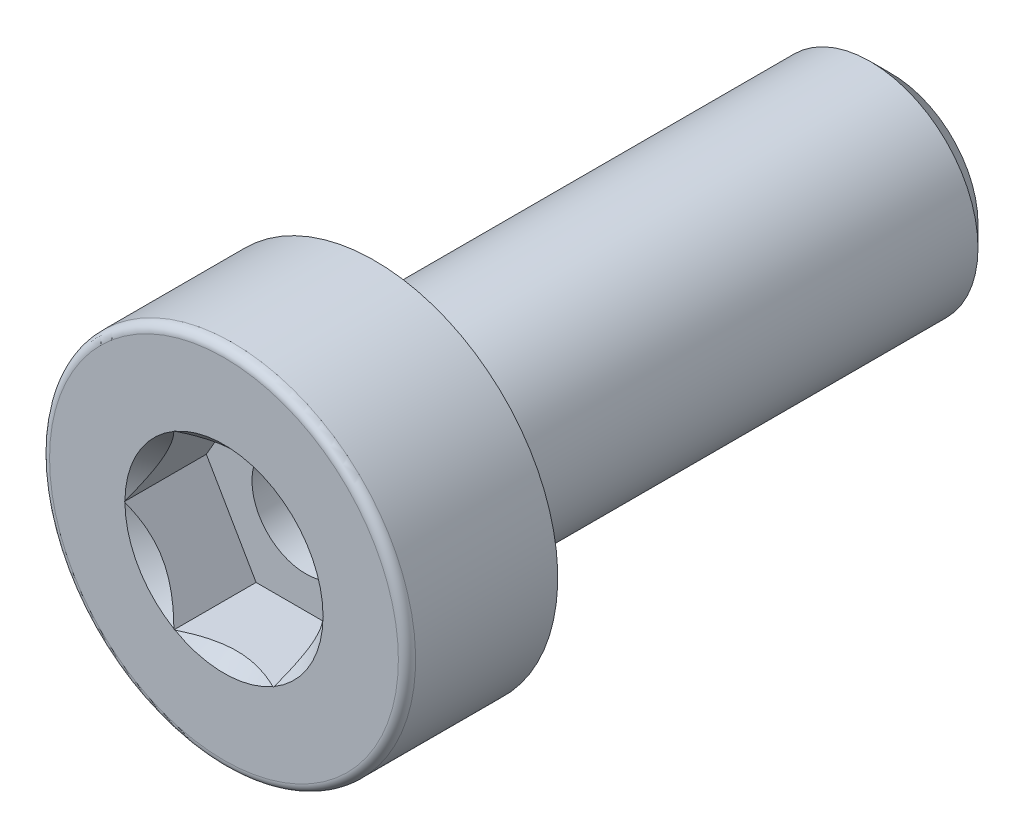
ISO-10303-21;
HEADER;
FILE_DESCRIPTION(('STEP AP214'),'2;1');
FILE_NAME('part.step','',(''),(''),'','','');
FILE_SCHEMA(('AUTOMOTIVE_DESIGN { 1 0 10303 214 1 1 1 1 }'));
ENDSEC;
DATA;
#1=APPLICATION_CONTEXT('core data for automotive mechanical design processes');
#2=APPLICATION_PROTOCOL_DEFINITION('international standard','automotive_design',2000,#1);
#3=PRODUCT_CONTEXT('',#1,'mechanical');
#4=PRODUCT('Part','Part','',(#3));
#5=PRODUCT_RELATED_PRODUCT_CATEGORY('part','',(#4));
#6=PRODUCT_DEFINITION_FORMATION('','',#4);
#7=PRODUCT_DEFINITION_CONTEXT('part definition',#1,'design');
#8=PRODUCT_DEFINITION('design','',#6,#7);
#9=PRODUCT_DEFINITION_SHAPE('','',#8);
#10=(LENGTH_UNIT() NAMED_UNIT(*) SI_UNIT(.MILLI.,.METRE.));
#11=(NAMED_UNIT(*) PLANE_ANGLE_UNIT() SI_UNIT($,.RADIAN.));
#12=(NAMED_UNIT(*) SI_UNIT($,.STERADIAN.) SOLID_ANGLE_UNIT());
#13=UNCERTAINTY_MEASURE_WITH_UNIT(LENGTH_MEASURE(1.E-05),#10,'distance_accuracy_value','');
#14=(GEOMETRIC_REPRESENTATION_CONTEXT(3) GLOBAL_UNCERTAINTY_ASSIGNED_CONTEXT((#13)) GLOBAL_UNIT_ASSIGNED_CONTEXT((#10,
#11,#12)) REPRESENTATION_CONTEXT('',''));
#15=CARTESIAN_POINT('',(0.,0.,0.));
#16=DIRECTION('',(0.,0.,1.));
#17=DIRECTION('',(1.,0.,0.));
#18=AXIS2_PLACEMENT_3D('',#15,#16,#17);
#19=CARTESIAN_POINT('',(-7.75,13.4233937586588,3.50000000003092));
#20=DIRECTION('',(0.,0.,1.));
#21=DIRECTION('',(1.,0.,0.));
#22=AXIS2_PLACEMENT_3D('',#19,#20,#21);
#23=CONICAL_SURFACE('',#22,1.25000000000114,1.04719755116304);
#24=CARTESIAN_POINT('',(-7.75,13.4233937586588,3.5));
#25=DIRECTION('',(0.,0.,-1.));
#26=DIRECTION('',(-1.,0.,0.));
#27=AXIS2_PLACEMENT_3D('',#24,#25,#26);
#28=CIRCLE('',#27,1.25);
#29=CARTESIAN_POINT('',(-9.,13.4233937586588,3.5));
#30=VERTEX_POINT('',#29);
#31=EDGE_CURVE('E386',#30,#30,#28,.F.);
#32=ORIENTED_EDGE('',*,*,#31,.T.);
#33=EDGE_LOOP('',(#32));
#34=FACE_BOUND('',#33,.T.);
#35=CARTESIAN_POINT('',(-7.75,13.4233937586588,2.77831216351387));
#36=VERTEX_POINT('',#35);
#37=VERTEX_LOOP('',#36);
#38=FACE_BOUND('',#37,.T.);
#39=ADVANCED_FACE('F16',(#34,#38),#23,.F.);
#40=CARTESIAN_POINT('',(-7.75,13.4233937586588,5.5));
#41=DIRECTION('',(0.,0.,-1.));
#42=DIRECTION('',(-1.,0.,0.));
#43=AXIS2_PLACEMENT_3D('',#40,#41,#42);
#44=CYLINDRICAL_SURFACE('',#43,1.25);
#45=ORIENTED_EDGE('',*,*,#31,.F.);
#46=EDGE_LOOP('',(#45));
#47=FACE_BOUND('',#46,.T.);
#48=CARTESIAN_POINT('',(-7.75,13.4233937586588,5.6));
#49=DIRECTION('',(0.,0.,-1.));
#50=DIRECTION('',(-1.,0.,0.));
#51=AXIS2_PLACEMENT_3D('',#48,#49,#50);
#52=CIRCLE('',#51,1.25);
#53=CARTESIAN_POINT('',(-9.,13.4233937586588,5.6));
#54=VERTEX_POINT('',#53);
#55=EDGE_CURVE('E342',#54,#54,#52,.T.);
#56=ORIENTED_EDGE('',*,*,#55,.F.);
#57=EDGE_LOOP('',(#56));
#58=FACE_BOUND('',#57,.T.);
#59=ADVANCED_FACE('F438',(#47,#58),#44,.F.);
#60=CARTESIAN_POINT('',(-7.75,13.4233937586588,5.6));
#61=DIRECTION('',(0.,0.,1.));
#62=DIRECTION('',(1.,0.,0.));
#63=AXIS2_PLACEMENT_3D('',#60,#61,#62);
#64=PLANE('',#63);
#65=DIRECTION('',(-0.5,-0.866025403784438,0.));
#66=VECTOR('',#65,1.);
#67=CARTESIAN_POINT('',(-8.90470053837925,15.4233937586588,5.6));
#68=LINE('',#67,#66);
#69=CARTESIAN_POINT('',(-8.90470053837925,15.4233937586588,5.6));
#70=VERTEX_POINT('',#69);
#71=CARTESIAN_POINT('',(-10.0594010767585,13.4233937586588,5.6));
#72=VERTEX_POINT('',#71);
#73=EDGE_CURVE('E317',#70,#72,#68,.T.);
#74=ORIENTED_EDGE('',*,*,#73,.T.);
#75=DIRECTION('',(0.5,-0.866025403784439,0.));
#76=VECTOR('',#75,1.);
#77=CARTESIAN_POINT('',(-10.0594010767585,13.4233937586588,5.6));
#78=LINE('',#77,#76);
#79=CARTESIAN_POINT('',(-8.90470053837925,11.4233937586588,5.6));
#80=VERTEX_POINT('',#79);
#81=EDGE_CURVE('E327',#72,#80,#78,.T.);
#82=ORIENTED_EDGE('',*,*,#81,.T.);
#83=DIRECTION('',(1.,0.,0.));
#84=VECTOR('',#83,1.);
#85=CARTESIAN_POINT('',(-8.90470053837925,11.4233937586588,5.6));
#86=LINE('',#85,#84);
#87=CARTESIAN_POINT('',(-6.59529946162075,11.4233937586588,5.6));
#88=VERTEX_POINT('',#87);
#89=EDGE_CURVE('E336',#80,#88,#86,.T.);
#90=ORIENTED_EDGE('',*,*,#89,.T.);
#91=DIRECTION('',(0.5,0.866025403784438,0.));
#92=VECTOR('',#91,1.);
#93=CARTESIAN_POINT('',(-6.59529946162075,11.4233937586588,5.6));
#94=LINE('',#93,#92);
#95=CARTESIAN_POINT('',(-5.44059892324149,13.4233937586588,5.6));
#96=VERTEX_POINT('',#95);
#97=EDGE_CURVE('E128',#88,#96,#94,.T.);
#98=ORIENTED_EDGE('',*,*,#97,.T.);
#99=DIRECTION('',(-0.5,0.866025403784439,0.));
#100=VECTOR('',#99,1.);
#101=CARTESIAN_POINT('',(-5.44059892324149,13.4233937586588,5.6));
#102=LINE('',#101,#100);
#103=CARTESIAN_POINT('',(-6.59529946162074,15.4233937586588,5.6));
#104=VERTEX_POINT('',#103);
#105=EDGE_CURVE('E347',#96,#104,#102,.T.);
#106=ORIENTED_EDGE('',*,*,#105,.T.);
#107=DIRECTION('',(-1.,0.,0.));
#108=VECTOR('',#107,1.);
#109=CARTESIAN_POINT('',(-6.59529946162074,15.4233937586588,5.6));
#110=LINE('',#109,#108);
#111=EDGE_CURVE('E307',#104,#70,#110,.T.);
#112=ORIENTED_EDGE('',*,*,#111,.T.);
#113=EDGE_LOOP('',(#74,#82,#90,#98,#106,#112));
#114=FACE_BOUND('',#113,.T.);
#115=ORIENTED_EDGE('',*,*,#55,.T.);
#116=EDGE_LOOP('',(#115));
#117=FACE_BOUND('',#116,.T.);
#118=ADVANCED_FACE('F435',(#114,#117),#64,.T.);
#119=CARTESIAN_POINT('',(-6.59529946162075,11.4233937586588,7.5));
#120=DIRECTION('',(0.866025403784438,-0.5,0.));
#121=DIRECTION('',(0.5,0.866025403784438,0.));
#122=AXIS2_PLACEMENT_3D('',#119,#120,#121);
#123=PLANE('',#122);
#124=DIRECTION('',(0.5,0.866025403784438,0.));
#125=VECTOR('',#124,1.);
#126=CARTESIAN_POINT('',(-6.59529946162075,11.4233937586588,7.5));
#127=LINE('',#126,#125);
#128=CARTESIAN_POINT('',(-5.44059892324149,13.4233937586588,7.50000000000001));
#129=VERTEX_POINT('',#128);
#130=CARTESIAN_POINT('',(-5.45005835785379,13.4070095372994,7.49999999996817));
#131=VERTEX_POINT('',#130);
#132=EDGE_CURVE('E119',#129,#131,#127,.F.);
#133=ORIENTED_EDGE('',*,*,#132,.F.);
#134=DIRECTION('',(0.,0.,1.));
#135=VECTOR('',#134,1.);
#136=CARTESIAN_POINT('',(-5.44059892324149,13.4233937586588,7.5));
#137=LINE('',#136,#135);
#138=EDGE_CURVE('E297',#129,#96,#137,.F.);
#139=ORIENTED_EDGE('',*,*,#138,.T.);
#140=ORIENTED_EDGE('',*,*,#97,.F.);
#141=DIRECTION('',(0.,0.,1.));
#142=VECTOR('',#141,1.);
#143=CARTESIAN_POINT('',(-6.59529946162075,11.4233937586588,7.5));
#144=LINE('',#143,#142);
#145=CARTESIAN_POINT('',(-6.59529946162075,11.4233937586588,7.50000000000001));
#146=VERTEX_POINT('',#145);
#147=EDGE_CURVE('E332',#88,#146,#144,.T.);
#148=ORIENTED_EDGE('',*,*,#147,.T.);
#149=DIRECTION('',(0.5,0.866025403784438,0.));
#150=VECTOR('',#149,1.);
#151=CARTESIAN_POINT('',(-6.59529946162075,11.4233937586588,7.50000000000002));
#152=LINE('',#151,#150);
#153=CARTESIAN_POINT('',(-6.58584002700847,11.4397779800181,7.49999999996818));
#154=VERTEX_POINT('',#153);
#155=EDGE_CURVE('E113',#154,#146,#152,.F.);
#156=ORIENTED_EDGE('',*,*,#155,.F.);
#157=CARTESIAN_POINT('',(-6.58584002700998,11.4397779800155,7.49999999996967));
#158=CARTESIAN_POINT('',(-6.54671425962928,11.507545797004,7.46139126550869));
#159=CARTESIAN_POINT('',(-6.50694003010778,11.5764367833672,7.42509450591187));
#160=CARTESIAN_POINT('',(-6.42586894770184,11.7168560171189,7.3587159205612));
#161=CARTESIAN_POINT('',(-6.38456486835022,11.7883967811157,7.32866971216834));
#162=CARTESIAN_POINT('',(-6.30128378787532,11.9326438438075,7.27724746086868));
#163=CARTESIAN_POINT('',(-6.25932670948011,12.0053156353251,7.2557459655005));
#164=CARTESIAN_POINT('',(-6.17451656397856,12.1522111163311,7.22266553530584));
#165=CARTESIAN_POINT('',(-6.13166588497014,12.2264306695125,7.21106294551236));
#166=CARTESIAN_POINT('',(-6.05734470450919,12.3551587301494,7.20057444952878));
#167=CARTESIAN_POINT('',(-6.02596278506847,12.4095138090598,7.19908068827765));
#168=CARTESIAN_POINT('',(-5.96325561707227,12.5181258100279,7.202008674053));
#169=CARTESIAN_POINT('',(-5.93193039170905,12.5723826919156,7.20643245497148));
#170=CARTESIAN_POINT('',(-5.86958247214765,12.6803724563421,7.22094215820634));
#171=CARTESIAN_POINT('',(-5.8385601316452,12.7341047262621,7.23103404393765));
#172=CARTESIAN_POINT('',(-5.77705157493901,12.8406406715774,7.25633229238579));
#173=CARTESIAN_POINT('',(-5.74656531579834,12.8934444213418,7.27153824351483));
#174=CARTESIAN_POINT('',(-5.67039765738511,13.025370675607,7.31551246792521));
#175=CARTESIAN_POINT('',(-5.62514516100914,13.1037502984996,7.34720930830145));
#176=CARTESIAN_POINT('',(-5.53634930697622,13.257549229186,7.41837525264461));
#177=CARTESIAN_POINT('',(-5.49280084265922,13.3329773819747,7.45781859302261));
#178=CARTESIAN_POINT('',(-5.45005835785227,13.4070095373021,7.49999999996967));
#179=B_SPLINE_CURVE_WITH_KNOTS('',3,(#157,#158,#159,#160,#161,#162,#163,#164,#165,#166,#167,
#168,#169,#170,#171,#172,#173,#174,#175,#176,#177,#178),.UNSPECIFIED.,.F.,.F.,(4,2,2,2,2,2,2,2,
2,2,4),(0.,0.261948226178639,0.525350520205881,0.784728452815865,1.04348481161264,
1.23156297192898,1.41970579236232,1.60804692971838,1.79637291271818,2.08361007435316,
2.36990763369227),.UNSPECIFIED.);
#180=EDGE_CURVE('E130',#154,#131,#179,.T.);
#181=ORIENTED_EDGE('',*,*,#180,.T.);
#182=EDGE_LOOP('',(#133,#139,#140,#148,#156,#181));
#183=FACE_BOUND('',#182,.T.);
#184=ADVANCED_FACE('F131',(#183),#123,.F.);
#185=CARTESIAN_POINT('',(-8.90470053837925,11.4233937586588,7.5));
#186=DIRECTION('',(0.,-1.,0.));
#187=DIRECTION('',(1.,0.,0.));
#188=AXIS2_PLACEMENT_3D('',#185,#186,#187);
#189=PLANE('',#188);
#190=DIRECTION('',(1.,0.,0.));
#191=VECTOR('',#190,1.);
#192=CARTESIAN_POINT('',(-8.90470053837925,11.4233937586588,7.5));
#193=LINE('',#192,#191);
#194=CARTESIAN_POINT('',(-6.61421833084533,11.4233937586588,7.49999999996817));
#195=VERTEX_POINT('',#194);
#196=EDGE_CURVE('E328',#146,#195,#193,.F.);
#197=ORIENTED_EDGE('',*,*,#196,.F.);
#198=ORIENTED_EDGE('',*,*,#147,.F.);
#199=ORIENTED_EDGE('',*,*,#89,.F.);
#200=DIRECTION('',(0.,0.,1.));
#201=VECTOR('',#200,1.);
#202=CARTESIAN_POINT('',(-8.90470053837925,11.4233937586588,7.5));
#203=LINE('',#202,#201);
#204=CARTESIAN_POINT('',(-8.90470053837925,11.4233937586588,7.50000000000001));
#205=VERTEX_POINT('',#204);
#206=EDGE_CURVE('E322',#80,#205,#203,.T.);
#207=ORIENTED_EDGE('',*,*,#206,.T.);
#208=DIRECTION('',(1.,0.,0.));
#209=VECTOR('',#208,1.);
#210=CARTESIAN_POINT('',(-8.90470053837925,11.4233937586588,7.50000000000002));
#211=LINE('',#210,#209);
#212=CARTESIAN_POINT('',(-8.88578166915469,11.4233937586588,7.49999999996818));
#213=VERTEX_POINT('',#212);
#214=EDGE_CURVE('E127',#213,#205,#211,.F.);
#215=ORIENTED_EDGE('',*,*,#214,.F.);
#216=CARTESIAN_POINT('',(-8.8857816691577,11.4233937586588,7.49999999996967));
#217=CARTESIAN_POINT('',(-8.8075301343963,11.4233937586588,7.46139126550869));
#218=CARTESIAN_POINT('',(-8.72798167535332,11.4233937586588,7.42509450591187));
#219=CARTESIAN_POINT('',(-8.56583951054143,11.4233937586588,7.35871592056121));
#220=CARTESIAN_POINT('',(-8.48323135183819,11.4233937586588,7.32866971216834));
#221=CARTESIAN_POINT('',(-8.31666919088839,11.4233937586588,7.27724746086868));
#222=CARTESIAN_POINT('',(-8.23275503409796,11.4233937586588,7.2557459655005));
#223=CARTESIAN_POINT('',(-8.06313474309488,11.4233937586588,7.22266553530585));
#224=CARTESIAN_POINT('',(-7.97743338507804,11.4233937586588,7.21106294551237));
#225=CARTESIAN_POINT('',(-7.82879102415614,11.4233937586588,7.20057444952878));
#226=CARTESIAN_POINT('',(-7.76602718527469,11.4233937586588,7.19908068827765));
#227=CARTESIAN_POINT('',(-7.64061284928229,11.4233937586588,7.202008674053));
#228=CARTESIAN_POINT('',(-7.57796239855587,11.4233937586588,7.20643245497148));
#229=CARTESIAN_POINT('',(-7.45326655943306,11.4233937586588,7.22094215820634));
#230=CARTESIAN_POINT('',(-7.39122187842815,11.4233937586588,7.23103404393765));
#231=CARTESIAN_POINT('',(-7.26820476501577,11.4233937586588,7.25633229238579));
#232=CARTESIAN_POINT('',(-7.20723224673444,11.4233937586588,7.27153824351483));
#233=CARTESIAN_POINT('',(-7.05489692990798,11.4233937586588,7.31551246792521));
#234=CARTESIAN_POINT('',(-6.96439193715603,11.4233937586588,7.34720930830145));
#235=CARTESIAN_POINT('',(-6.78680022909019,11.4233937586588,7.41837525264461));
#236=CARTESIAN_POINT('',(-6.69970330045618,11.4233937586588,7.45781859302261));
#237=CARTESIAN_POINT('',(-6.61421833084229,11.4233937586588,7.49999999996967));
#238=B_SPLINE_CURVE_WITH_KNOTS('',3,(#216,#217,#218,#219,#220,#221,#222,#223,#224,#225,#226,
#227,#228,#229,#230,#231,#232,#233,#234,#235,#236,#237),.UNSPECIFIED.,.F.,.F.,(4,2,2,2,2,2,2,2,
2,2,4),(0.,0.261948226178633,0.525350520205877,0.784728452815857,1.04348481161264,
1.23156297192898,1.41970579236232,1.60804692971837,1.79637291271818,2.08361007435316,
2.36990763369227),.UNSPECIFIED.);
#239=EDGE_CURVE('E133',#213,#195,#238,.T.);
#240=ORIENTED_EDGE('',*,*,#239,.T.);
#241=EDGE_LOOP('',(#197,#198,#199,#207,#215,#240));
#242=FACE_BOUND('',#241,.T.);
#243=ADVANCED_FACE('F204',(#242),#189,.F.);
#244=CARTESIAN_POINT('',(-10.0594010767585,13.4233937586588,7.5));
#245=DIRECTION('',(-0.866025403784439,-0.5,0.));
#246=DIRECTION('',(0.5,-0.866025403784439,0.));
#247=AXIS2_PLACEMENT_3D('',#244,#245,#246);
#248=PLANE('',#247);
#249=DIRECTION('',(0.5,-0.866025403784439,0.));
#250=VECTOR('',#249,1.);
#251=CARTESIAN_POINT('',(-10.0594010767585,13.4233937586588,7.5));
#252=LINE('',#251,#250);
#253=CARTESIAN_POINT('',(-8.91415997299154,11.4397779800182,7.49999999996817));
#254=VERTEX_POINT('',#253);
#255=EDGE_CURVE('E318',#205,#254,#252,.F.);
#256=ORIENTED_EDGE('',*,*,#255,.F.);
#257=ORIENTED_EDGE('',*,*,#206,.F.);
#258=ORIENTED_EDGE('',*,*,#81,.F.);
#259=DIRECTION('',(0.,0.,1.));
#260=VECTOR('',#259,1.);
#261=CARTESIAN_POINT('',(-10.0594010767585,13.4233937586588,7.5));
#262=LINE('',#261,#260);
#263=CARTESIAN_POINT('',(-10.0594010767585,13.4233937586588,7.50000000000001));
#264=VERTEX_POINT('',#263);
#265=EDGE_CURVE('E312',#72,#264,#262,.T.);
#266=ORIENTED_EDGE('',*,*,#265,.T.);
#267=DIRECTION('',(0.5,-0.866025403784439,0.));
#268=VECTOR('',#267,1.);
#269=CARTESIAN_POINT('',(-10.0594010767585,13.4233937586588,7.50000000000002));
#270=LINE('',#269,#268);
#271=CARTESIAN_POINT('',(-10.0499416421462,13.4070095372995,7.49999999996818));
#272=VERTEX_POINT('',#271);
#273=EDGE_CURVE('E325',#272,#264,#270,.F.);
#274=ORIENTED_EDGE('',*,*,#273,.F.);
#275=CARTESIAN_POINT('',(-10.0499416421477,13.4070095373021,7.49999999996966));
#276=CARTESIAN_POINT('',(-10.010815874767,13.3392417203136,7.46139126550869));
#277=CARTESIAN_POINT('',(-9.97104164524553,13.2703507339504,7.42509450591186));
#278=CARTESIAN_POINT('',(-9.88997056283959,13.1299315001987,7.3587159205612));
#279=CARTESIAN_POINT('',(-9.84866648348797,13.0583907362019,7.32866971216833));
#280=CARTESIAN_POINT('',(-9.76538540301307,12.9141436735101,7.27724746086868));
#281=CARTESIAN_POINT('',(-9.72342832461786,12.8414718819925,7.2557459655005));
#282=CARTESIAN_POINT('',(-9.63861817911631,12.6945764009865,7.22266553530584));
#283=CARTESIAN_POINT('',(-9.59576750010789,12.6203568478051,7.21106294551236));
#284=CARTESIAN_POINT('',(-9.52144631964694,12.4916287871682,7.20057444952878));
#285=CARTESIAN_POINT('',(-9.49006440020622,12.4372737082578,7.19908068827764));
#286=CARTESIAN_POINT('',(-9.42735723221002,12.3286617072897,7.202008674053));
#287=CARTESIAN_POINT('',(-9.39603200684681,12.274404825402,7.20643245497148));
#288=CARTESIAN_POINT('',(-9.33368408728541,12.1664150609755,7.22094215820634));
#289=CARTESIAN_POINT('',(-9.30266174678295,12.1126827910555,7.23103404393764));
#290=CARTESIAN_POINT('',(-9.24115319007676,12.0061468457402,7.25633229238579));
#291=CARTESIAN_POINT('',(-9.21066693093609,11.9533430959758,7.27153824351483));
#292=CARTESIAN_POINT('',(-9.13449927252286,11.8214168417106,7.31551246792521));
#293=CARTESIAN_POINT('',(-9.08924677614689,11.743037218818,7.34720930830144));
#294=CARTESIAN_POINT('',(-9.00045092211397,11.5892382881316,7.41837525264461));
#295=CARTESIAN_POINT('',(-8.95690245779697,11.5138101353429,7.45781859302261));
#296=CARTESIAN_POINT('',(-8.91415997299002,11.4397779800155,7.49999999996966));
#297=B_SPLINE_CURVE_WITH_KNOTS('',3,(#275,#276,#277,#278,#279,#280,#281,#282,#283,#284,#285,
#286,#287,#288,#289,#290,#291,#292,#293,#294,#295,#296),.UNSPECIFIED.,.F.,.F.,(4,2,2,2,2,2,2,2,
2,2,4),(0.,0.261948226178637,0.525350520205881,0.784728452815862,1.04348481161264,
1.23156297192898,1.41970579236232,1.60804692971838,1.79637291271818,2.08361007435316,
2.36990763369227),.UNSPECIFIED.);
#298=EDGE_CURVE('E188',#272,#254,#297,.T.);
#299=ORIENTED_EDGE('',*,*,#298,.T.);
#300=EDGE_LOOP('',(#256,#257,#258,#266,#274,#299));
#301=FACE_BOUND('',#300,.T.);
#302=ADVANCED_FACE('F198',(#301),#248,.F.);
#303=CARTESIAN_POINT('',(-8.90470053837925,15.4233937586588,7.5));
#304=DIRECTION('',(-0.866025403784438,0.5,0.));
#305=DIRECTION('',(-0.5,-0.866025403784438,0.));
#306=AXIS2_PLACEMENT_3D('',#303,#304,#305);
#307=PLANE('',#306);
#308=DIRECTION('',(-0.5,-0.866025403784438,0.));
#309=VECTOR('',#308,1.);
#310=CARTESIAN_POINT('',(-8.90470053837925,15.4233937586588,7.5));
#311=LINE('',#310,#309);
#312=CARTESIAN_POINT('',(-10.0499416421462,13.4397779800182,7.49999999996817));
#313=VERTEX_POINT('',#312);
#314=EDGE_CURVE('E308',#264,#313,#311,.F.);
#315=ORIENTED_EDGE('',*,*,#314,.F.);
#316=ORIENTED_EDGE('',*,*,#265,.F.);
#317=ORIENTED_EDGE('',*,*,#73,.F.);
#318=DIRECTION('',(0.,0.,1.));
#319=VECTOR('',#318,1.);
#320=CARTESIAN_POINT('',(-8.90470053837925,15.4233937586588,7.5));
#321=LINE('',#320,#319);
#322=CARTESIAN_POINT('',(-8.90470053837925,15.4233937586588,7.50000000000001));
#323=VERTEX_POINT('',#322);
#324=EDGE_CURVE('E302',#70,#323,#321,.T.);
#325=ORIENTED_EDGE('',*,*,#324,.T.);
#326=DIRECTION('',(-0.5,-0.866025403784438,0.));
#327=VECTOR('',#326,1.);
#328=CARTESIAN_POINT('',(-8.90470053837925,15.4233937586588,7.50000000000002));
#329=LINE('',#328,#327);
#330=CARTESIAN_POINT('',(-8.91415997299153,15.4070095372995,7.49999999996818));
#331=VERTEX_POINT('',#330);
#332=EDGE_CURVE('E315',#331,#323,#329,.F.);
#333=ORIENTED_EDGE('',*,*,#332,.F.);
#334=CARTESIAN_POINT('',(-8.91415997299002,15.4070095373021,7.49999999996967));
#335=CARTESIAN_POINT('',(-8.95328574037072,15.3392417203136,7.46139126550869));
#336=CARTESIAN_POINT('',(-8.99305996989222,15.2703507339504,7.42509450591187));
#337=CARTESIAN_POINT('',(-9.07413105229816,15.1299315001987,7.35871592056121));
#338=CARTESIAN_POINT('',(-9.11543513164978,15.0583907362019,7.32866971216834));
#339=CARTESIAN_POINT('',(-9.19871621212468,14.9141436735101,7.27724746086868));
#340=CARTESIAN_POINT('',(-9.24067329051989,14.8414718819925,7.2557459655005));
#341=CARTESIAN_POINT('',(-9.32548343602144,14.6945764009865,7.22266553530584));
#342=CARTESIAN_POINT('',(-9.36833411502986,14.6203568478051,7.21106294551236));
#343=CARTESIAN_POINT('',(-9.44265529549081,14.4916287871682,7.20057444952878));
#344=CARTESIAN_POINT('',(-9.47403721493153,14.4372737082578,7.19908068827765));
#345=CARTESIAN_POINT('',(-9.53674438292773,14.3286617072897,7.202008674053));
#346=CARTESIAN_POINT('',(-9.56806960829095,14.274404825402,7.20643245497148));
#347=CARTESIAN_POINT('',(-9.63041752785235,14.1664150609755,7.22094215820634));
#348=CARTESIAN_POINT('',(-9.66143986835481,14.1126827910555,7.23103404393765));
#349=CARTESIAN_POINT('',(-9.72294842506099,14.0061468457402,7.25633229238579));
#350=CARTESIAN_POINT('',(-9.75343468420166,13.9533430959758,7.27153824351483));
#351=CARTESIAN_POINT('',(-9.82960234261489,13.8214168417105,7.31551246792521));
#352=CARTESIAN_POINT('',(-9.87485483899086,13.743037218818,7.34720930830145));
#353=CARTESIAN_POINT('',(-9.96365069302378,13.5892382881316,7.41837525264461));
#354=CARTESIAN_POINT('',(-10.0071991573408,13.5138101353429,7.45781859302261));
#355=CARTESIAN_POINT('',(-10.0499416421477,13.4397779800155,7.49999999996967));
#356=B_SPLINE_CURVE_WITH_KNOTS('',3,(#334,#335,#336,#337,#338,#339,#340,#341,#342,#343,#344,
#345,#346,#347,#348,#349,#350,#351,#352,#353,#354,#355),.UNSPECIFIED.,.F.,.F.,(4,2,2,2,2,2,2,2,
2,2,4),(0.,0.261948226178638,0.525350520205881,0.784728452815864,1.04348481161264,
1.23156297192899,1.41970579236232,1.60804692971838,1.79637291271819,2.08361007435316,
2.36990763369227),.UNSPECIFIED.);
#357=EDGE_CURVE('E181',#331,#313,#356,.T.);
#358=ORIENTED_EDGE('',*,*,#357,.T.);
#359=EDGE_LOOP('',(#315,#316,#317,#325,#333,#358));
#360=FACE_BOUND('',#359,.T.);
#361=ADVANCED_FACE('F194',(#360),#307,.F.);
#362=CARTESIAN_POINT('',(-6.59529946162074,15.4233937586588,7.5));
#363=DIRECTION('',(0.,1.,0.));
#364=DIRECTION('',(-1.,0.,0.));
#365=AXIS2_PLACEMENT_3D('',#362,#363,#364);
#366=PLANE('',#365);
#367=DIRECTION('',(-1.,0.,0.));
#368=VECTOR('',#367,1.);
#369=CARTESIAN_POINT('',(-6.59529946162074,15.4233937586588,7.5));
#370=LINE('',#369,#368);
#371=CARTESIAN_POINT('',(-8.88578166915467,15.4233937586588,7.49999999996817));
#372=VERTEX_POINT('',#371);
#373=EDGE_CURVE('E298',#323,#372,#370,.F.);
#374=ORIENTED_EDGE('',*,*,#373,.F.);
#375=ORIENTED_EDGE('',*,*,#324,.F.);
#376=ORIENTED_EDGE('',*,*,#111,.F.);
#377=DIRECTION('',(0.,0.,1.));
#378=VECTOR('',#377,1.);
#379=CARTESIAN_POINT('',(-6.59529946162074,15.4233937586588,7.5));
#380=LINE('',#379,#378);
#381=CARTESIAN_POINT('',(-6.59529946162074,15.4233937586588,7.50000000000001));
#382=VERTEX_POINT('',#381);
#383=EDGE_CURVE('E293',#104,#382,#380,.T.);
#384=ORIENTED_EDGE('',*,*,#383,.T.);
#385=DIRECTION('',(-1.,0.,0.));
#386=VECTOR('',#385,1.);
#387=CARTESIAN_POINT('',(-6.59529946162074,15.4233937586588,7.50000000000002));
#388=LINE('',#387,#386);
#389=CARTESIAN_POINT('',(-6.61421833084531,15.4233937586588,7.49999999996818));
#390=VERTEX_POINT('',#389);
#391=EDGE_CURVE('E305',#390,#382,#388,.F.);
#392=ORIENTED_EDGE('',*,*,#391,.F.);
#393=CARTESIAN_POINT('',(-6.61421833084229,15.4233937586588,7.49999999996967));
#394=CARTESIAN_POINT('',(-6.69246986560369,15.4233937586588,7.46139126550869));
#395=CARTESIAN_POINT('',(-6.77201832464668,15.4233937586588,7.42509450591187));
#396=CARTESIAN_POINT('',(-6.93416048945857,15.4233937586588,7.35871592056121));
#397=CARTESIAN_POINT('',(-7.01676864816181,15.4233937586588,7.32866971216834));
#398=CARTESIAN_POINT('',(-7.18333080911161,15.4233937586588,7.27724746086869));
#399=CARTESIAN_POINT('',(-7.26724496590203,15.4233937586588,7.2557459655005));
#400=CARTESIAN_POINT('',(-7.43686525690512,15.4233937586588,7.22266553530585));
#401=CARTESIAN_POINT('',(-7.52256661492196,15.4233937586588,7.21106294551237));
#402=CARTESIAN_POINT('',(-7.67120897584386,15.4233937586588,7.20057444952878));
#403=CARTESIAN_POINT('',(-7.7339728147253,15.4233937586588,7.19908068827765));
#404=CARTESIAN_POINT('',(-7.8593871507177,15.4233937586588,7.202008674053));
#405=CARTESIAN_POINT('',(-7.92203760144413,15.4233937586588,7.20643245497148));
#406=CARTESIAN_POINT('',(-8.04673344056694,15.4233937586588,7.22094215820634));
#407=CARTESIAN_POINT('',(-8.10877812157185,15.4233937586588,7.23103404393765));
#408=CARTESIAN_POINT('',(-8.23179523498423,15.4233937586588,7.25633229238579));
#409=CARTESIAN_POINT('',(-8.29276775326556,15.4233937586588,7.27153824351483));
#410=CARTESIAN_POINT('',(-8.44510307009202,15.4233937586588,7.31551246792521));
#411=CARTESIAN_POINT('',(-8.53560806284397,15.4233937586588,7.34720930830145));
#412=CARTESIAN_POINT('',(-8.71319977090981,15.4233937586588,7.41837525264461));
#413=CARTESIAN_POINT('',(-8.80029669954381,15.4233937586588,7.45781859302261));
#414=CARTESIAN_POINT('',(-8.8857816691577,15.4233937586588,7.49999999996967));
#415=B_SPLINE_CURVE_WITH_KNOTS('',3,(#393,#394,#395,#396,#397,#398,#399,#400,#401,#402,#403,
#404,#405,#406,#407,#408,#409,#410,#411,#412,#413,#414),.UNSPECIFIED.,.F.,.F.,(4,2,2,2,2,2,2,2,
2,2,4),(0.,0.261948226178637,0.525350520205881,0.784728452815863,1.04348481161264,
1.23156297192898,1.41970579236232,1.60804692971838,1.79637291271819,2.08361007435316,
2.36990763369227),.UNSPECIFIED.);
#416=EDGE_CURVE('E144',#390,#372,#415,.T.);
#417=ORIENTED_EDGE('',*,*,#416,.T.);
#418=EDGE_LOOP('',(#374,#375,#376,#384,#392,#417));
#419=FACE_BOUND('',#418,.T.);
#420=ADVANCED_FACE('F197',(#419),#366,.F.);
#421=CARTESIAN_POINT('',(-5.44059892324149,13.4233937586588,7.5));
#422=DIRECTION('',(0.866025403784439,0.5,0.));
#423=DIRECTION('',(-0.5,0.866025403784439,0.));
#424=AXIS2_PLACEMENT_3D('',#421,#422,#423);
#425=PLANE('',#424);
#426=DIRECTION('',(-0.5,0.866025403784439,0.));
#427=VECTOR('',#426,1.);
#428=CARTESIAN_POINT('',(-5.44059892324149,13.4233937586588,7.5));
#429=LINE('',#428,#427);
#430=CARTESIAN_POINT('',(-6.58584002700844,15.4070095372994,7.49999999996817));
#431=VERTEX_POINT('',#430);
#432=EDGE_CURVE('E134',#382,#431,#429,.F.);
#433=ORIENTED_EDGE('',*,*,#432,.F.);
#434=ORIENTED_EDGE('',*,*,#383,.F.);
#435=ORIENTED_EDGE('',*,*,#105,.F.);
#436=ORIENTED_EDGE('',*,*,#138,.F.);
#437=DIRECTION('',(-0.5,0.866025403784439,0.));
#438=VECTOR('',#437,1.);
#439=CARTESIAN_POINT('',(-5.44059892324149,13.4233937586588,7.50000000000002));
#440=LINE('',#439,#438);
#441=CARTESIAN_POINT('',(-5.45005835785378,13.4397779800182,7.49999999996818));
#442=VERTEX_POINT('',#441);
#443=EDGE_CURVE('E124',#442,#129,#440,.F.);
#444=ORIENTED_EDGE('',*,*,#443,.F.);
#445=CARTESIAN_POINT('',(-5.45005835785227,13.4397779800155,7.49999999996967));
#446=CARTESIAN_POINT('',(-5.48918412523297,13.507545797004,7.46139126550869));
#447=CARTESIAN_POINT('',(-5.52895835475446,13.5764367833672,7.42509450591187));
#448=CARTESIAN_POINT('',(-5.6100294371604,13.7168560171189,7.35871592056121));
#449=CARTESIAN_POINT('',(-5.65133351651202,13.7883967811157,7.32866971216835));
#450=CARTESIAN_POINT('',(-5.73461459698692,13.9326438438075,7.27724746086869));
#451=CARTESIAN_POINT('',(-5.77657167538213,14.0053156353251,7.25574596550051));
#452=CARTESIAN_POINT('',(-5.86138182088368,14.1522111163311,7.22266553530585));
#453=CARTESIAN_POINT('',(-5.9042324998921,14.2264306695125,7.21106294551237));
#454=CARTESIAN_POINT('',(-5.97855368035305,14.3551587301494,7.20057444952879));
#455=CARTESIAN_POINT('',(-6.00993559979377,14.4095138090598,7.19908068827765));
#456=CARTESIAN_POINT('',(-6.07264276778997,14.5181258100279,7.20200867405301));
#457=CARTESIAN_POINT('',(-6.10396799315318,14.5723826919156,7.20643245497149));
#458=CARTESIAN_POINT('',(-6.16631591271459,14.6803724563421,7.22094215820634));
#459=CARTESIAN_POINT('',(-6.19733825321704,14.7341047262621,7.23103404393765));
#460=CARTESIAN_POINT('',(-6.25884680992323,14.8406406715774,7.25633229238579));
#461=CARTESIAN_POINT('',(-6.2893330690639,14.8934444213418,7.27153824351484));
#462=CARTESIAN_POINT('',(-6.36550072747713,15.0253706756071,7.31551246792522));
#463=CARTESIAN_POINT('',(-6.4107532238531,15.1037502984996,7.34720930830145));
#464=CARTESIAN_POINT('',(-6.49954907788602,15.257549229186,7.41837525264462));
#465=CARTESIAN_POINT('',(-6.54309754220302,15.3329773819747,7.45781859302262));
#466=CARTESIAN_POINT('',(-6.58584002700997,15.4070095373021,7.49999999996967));
#467=B_SPLINE_CURVE_WITH_KNOTS('',3,(#445,#446,#447,#448,#449,#450,#451,#452,#453,#454,#455,
#456,#457,#458,#459,#460,#461,#462,#463,#464,#465,#466),.UNSPECIFIED.,.F.,.F.,(4,2,2,2,2,2,2,2,
2,2,4),(0.,0.261948226178634,0.525350520205876,0.784728452815858,1.04348481161263,
1.23156297192897,1.41970579236232,1.60804692971837,1.79637291271818,2.08361007435315,
2.36990763369226),.UNSPECIFIED.);
#468=EDGE_CURVE('E138',#442,#431,#467,.T.);
#469=ORIENTED_EDGE('',*,*,#468,.T.);
#470=EDGE_LOOP('',(#433,#434,#435,#436,#444,#469));
#471=FACE_BOUND('',#470,.T.);
#472=ADVANCED_FACE('F159',(#471),#425,.F.);
#473=CARTESIAN_POINT('',(-7.75,13.4233937586588,7.49999999987949));
#474=DIRECTION('',(0.,0.,1.));
#475=DIRECTION('',(1.,0.,0.));
#476=AXIS2_PLACEMENT_3D('',#473,#474,#475);
#477=CONICAL_SURFACE('',#476,2.29999999990866,0.785398163396902);
#478=CARTESIAN_POINT('',(-7.75,13.4233937586588,7.49999999993634));
#479=DIRECTION('',(0.,0.,1.));
#480=DIRECTION('',(1.,0.,0.));
#481=AXIS2_PLACEMENT_3D('',#478,#479,#480);
#482=CIRCLE('',#481,2.29999999996551);
#483=EDGE_CURVE('E122',#131,#154,#482,.F.);
#484=ORIENTED_EDGE('',*,*,#483,.F.);
#485=ORIENTED_EDGE('',*,*,#180,.F.);
#486=EDGE_LOOP('',(#484,#485));
#487=FACE_BOUND('',#486,.T.);
#488=ADVANCED_FACE('F136',(#487),#477,.F.);
#489=CARTESIAN_POINT('',(-7.75,13.4233937586588,7.49999999987949));
#490=DIRECTION('',(0.,0.,1.));
#491=DIRECTION('',(1.,0.,0.));
#492=AXIS2_PLACEMENT_3D('',#489,#490,#491);
#493=CONICAL_SURFACE('',#492,2.29999999990866,0.785398163396902);
#494=CARTESIAN_POINT('',(-7.75,13.4233937586588,7.49999999993634));
#495=DIRECTION('',(0.,0.,1.));
#496=DIRECTION('',(1.,0.,0.));
#497=AXIS2_PLACEMENT_3D('',#494,#495,#496);
#498=CIRCLE('',#497,2.29999999996551);
#499=EDGE_CURVE('E137',#195,#213,#498,.F.);
#500=ORIENTED_EDGE('',*,*,#499,.F.);
#501=ORIENTED_EDGE('',*,*,#239,.F.);
#502=EDGE_LOOP('',(#500,#501));
#503=FACE_BOUND('',#502,.T.);
#504=ADVANCED_FACE('F220',(#503),#493,.F.);
#505=CARTESIAN_POINT('',(-7.75,13.4233937586588,7.49999999987949));
#506=DIRECTION('',(0.,0.,1.));
#507=DIRECTION('',(1.,0.,0.));
#508=AXIS2_PLACEMENT_3D('',#505,#506,#507);
#509=CONICAL_SURFACE('',#508,2.29999999990866,0.785398163396902);
#510=CARTESIAN_POINT('',(-7.75,13.4233937586588,7.49999999993634));
#511=DIRECTION('',(0.,0.,1.));
#512=DIRECTION('',(1.,0.,0.));
#513=AXIS2_PLACEMENT_3D('',#510,#511,#512);
#514=CIRCLE('',#513,2.29999999996551);
#515=EDGE_CURVE('E141',#254,#272,#514,.F.);
#516=ORIENTED_EDGE('',*,*,#515,.F.);
#517=ORIENTED_EDGE('',*,*,#298,.F.);
#518=EDGE_LOOP('',(#516,#517));
#519=FACE_BOUND('',#518,.T.);
#520=ADVANCED_FACE('F177',(#519),#509,.F.);
#521=CARTESIAN_POINT('',(-7.75,13.4233937586588,7.49999999987949));
#522=DIRECTION('',(0.,0.,1.));
#523=DIRECTION('',(1.,0.,0.));
#524=AXIS2_PLACEMENT_3D('',#521,#522,#523);
#525=CONICAL_SURFACE('',#524,2.29999999990866,0.785398163396902);
#526=CARTESIAN_POINT('',(-7.75,13.4233937586588,7.49999999993634));
#527=DIRECTION('',(0.,0.,1.));
#528=DIRECTION('',(1.,0.,0.));
#529=AXIS2_PLACEMENT_3D('',#526,#527,#528);
#530=CIRCLE('',#529,2.29999999996551);
#531=EDGE_CURVE('E401',#313,#331,#530,.F.);
#532=ORIENTED_EDGE('',*,*,#531,.F.);
#533=ORIENTED_EDGE('',*,*,#357,.F.);
#534=EDGE_LOOP('',(#532,#533));
#535=FACE_BOUND('',#534,.T.);
#536=ADVANCED_FACE('F172',(#535),#525,.F.);
#537=CARTESIAN_POINT('',(-7.75,13.4233937586588,7.49999999987949));
#538=DIRECTION('',(0.,0.,1.));
#539=DIRECTION('',(1.,0.,0.));
#540=AXIS2_PLACEMENT_3D('',#537,#538,#539);
#541=CONICAL_SURFACE('',#540,2.29999999990866,0.785398163396902);
#542=CARTESIAN_POINT('',(-7.75,13.4233937586588,7.49999999993634));
#543=DIRECTION('',(0.,0.,1.));
#544=DIRECTION('',(1.,0.,0.));
#545=AXIS2_PLACEMENT_3D('',#542,#543,#544);
#546=CIRCLE('',#545,2.29999999996551);
#547=EDGE_CURVE('E398',#372,#390,#546,.F.);
#548=ORIENTED_EDGE('',*,*,#547,.F.);
#549=ORIENTED_EDGE('',*,*,#416,.F.);
#550=EDGE_LOOP('',(#548,#549));
#551=FACE_BOUND('',#550,.T.);
#552=ADVANCED_FACE('F166',(#551),#541,.F.);
#553=CARTESIAN_POINT('',(-7.75,13.4233937586588,7.49999999987949));
#554=DIRECTION('',(0.,0.,1.));
#555=DIRECTION('',(1.,0.,0.));
#556=AXIS2_PLACEMENT_3D('',#553,#554,#555);
#557=CONICAL_SURFACE('',#556,2.29999999990866,0.785398163396902);
#558=CARTESIAN_POINT('',(-7.75,13.4233937586588,7.49999999993634));
#559=DIRECTION('',(0.,0.,1.));
#560=DIRECTION('',(1.,0.,0.));
#561=AXIS2_PLACEMENT_3D('',#558,#559,#560);
#562=CIRCLE('',#561,2.29999999996551);
#563=EDGE_CURVE('E396',#431,#442,#562,.F.);
#564=ORIENTED_EDGE('',*,*,#563,.F.);
#565=ORIENTED_EDGE('',*,*,#468,.F.);
#566=EDGE_LOOP('',(#564,#565));
#567=FACE_BOUND('',#566,.T.);
#568=ADVANCED_FACE('F162',(#567),#557,.F.);
#569=CARTESIAN_POINT('',(-9.3375,16.1730244156744,7.50000000000002));
#570=DIRECTION('',(0.,0.,1.));
#571=DIRECTION('',(1.,0.,0.));
#572=AXIS2_PLACEMENT_3D('',#569,#570,#571);
#573=PLANE('',#572);
#574=ORIENTED_EDGE('',*,*,#432,.T.);
#575=ORIENTED_EDGE('',*,*,#563,.T.);
#576=ORIENTED_EDGE('',*,*,#443,.T.);
#577=ORIENTED_EDGE('',*,*,#132,.T.);
#578=ORIENTED_EDGE('',*,*,#483,.T.);
#579=ORIENTED_EDGE('',*,*,#155,.T.);
#580=ORIENTED_EDGE('',*,*,#196,.T.);
#581=ORIENTED_EDGE('',*,*,#499,.T.);
#582=ORIENTED_EDGE('',*,*,#214,.T.);
#583=ORIENTED_EDGE('',*,*,#255,.T.);
#584=ORIENTED_EDGE('',*,*,#515,.T.);
#585=ORIENTED_EDGE('',*,*,#273,.T.);
#586=ORIENTED_EDGE('',*,*,#314,.T.);
#587=ORIENTED_EDGE('',*,*,#531,.T.);
#588=ORIENTED_EDGE('',*,*,#332,.T.);
#589=ORIENTED_EDGE('',*,*,#373,.T.);
#590=ORIENTED_EDGE('',*,*,#547,.T.);
#591=ORIENTED_EDGE('',*,*,#391,.T.);
#592=EDGE_LOOP('',(#574,#575,#576,#577,#578,#579,#580,#581,#582,#583,#584,#585,#586,#587,#588,
#589,#590,#591));
#593=FACE_BOUND('',#592,.T.);
#594=CARTESIAN_POINT('',(-7.75,13.4233937586588,7.50000000000002));
#595=DIRECTION('',(0.,0.,-1.));
#596=DIRECTION('',(0.5,-0.866025403784439,0.));
#597=AXIS2_PLACEMENT_3D('',#594,#595,#596);
#598=CIRCLE('',#597,4.05000000000001);
#599=CARTESIAN_POINT('',(-5.725,9.91599087333182,7.50000000000002));
#600=VERTEX_POINT('',#599);
#601=CARTESIAN_POINT('',(-9.775,16.9307966439858,7.50000000000002));
#602=VERTEX_POINT('',#601);
#603=EDGE_CURVE('E35',#600,#602,#598,.T.);
#604=ORIENTED_EDGE('',*,*,#603,.F.);
#605=CARTESIAN_POINT('',(-7.75,13.4233937586588,7.50000000000002));
#606=DIRECTION('',(0.,0.,-1.));
#607=DIRECTION('',(-0.5,0.866025403784439,0.));
#608=AXIS2_PLACEMENT_3D('',#605,#606,#607);
#609=CIRCLE('',#608,4.05000000000002);
#610=EDGE_CURVE('E275',#602,#600,#609,.T.);
#611=ORIENTED_EDGE('',*,*,#610,.F.);
#612=EDGE_LOOP('',(#604,#611));
#613=FACE_BOUND('',#612,.T.);
#614=ADVANCED_FACE('F120',(#593,#613),#573,.T.);
#615=CARTESIAN_POINT('',(-7.75,13.4233937586588,7.30000000000002));
#616=DIRECTION('',(0.,0.,1.));
#617=DIRECTION('',(-0.5,0.866025403784439,0.));
#618=AXIS2_PLACEMENT_3D('',#615,#616,#617);
#619=TOROIDAL_SURFACE('',#618,4.05,0.199999999999999);
#620=ORIENTED_EDGE('',*,*,#603,.T.);
#621=ORIENTED_EDGE('',*,*,#610,.T.);
#622=EDGE_LOOP('',(#620,#621));
#623=FACE_BOUND('',#622,.T.);
#624=CARTESIAN_POINT('',(-7.75,13.4233937586588,7.30000000000002));
#625=DIRECTION('',(0.,0.,-1.));
#626=DIRECTION('',(-1.,0.,0.));
#627=AXIS2_PLACEMENT_3D('',#624,#625,#626);
#628=CIRCLE('',#627,4.25);
#629=CARTESIAN_POINT('',(-12.,13.4233937586588,7.30000000000002));
#630=VERTEX_POINT('',#629);
#631=EDGE_CURVE('E264',#630,#630,#628,.T.);
#632=ORIENTED_EDGE('',*,*,#631,.F.);
#633=EDGE_LOOP('',(#632));
#634=FACE_BOUND('',#633,.T.);
#635=ADVANCED_FACE('F254',(#623,#634),#619,.T.);
#636=CARTESIAN_POINT('',(-7.75,13.4233937586588,5.65000000000002));
#637=DIRECTION('',(0.,0.,-1.));
#638=DIRECTION('',(-1.,0.,0.));
#639=AXIS2_PLACEMENT_3D('',#636,#637,#638);
#640=CYLINDRICAL_SURFACE('',#639,4.25);
#641=ORIENTED_EDGE('',*,*,#631,.T.);
#642=EDGE_LOOP('',(#641));
#643=FACE_BOUND('',#642,.T.);
#644=CARTESIAN_POINT('',(-7.75,13.4233937586588,4.00000000000001));
#645=DIRECTION('',(0.,0.,-1.));
#646=DIRECTION('',(-1.,0.,0.));
#647=AXIS2_PLACEMENT_3D('',#644,#645,#646);
#648=CIRCLE('',#647,4.25);
#649=CARTESIAN_POINT('',(-12.,13.4233937586588,4.00000000000001));
#650=VERTEX_POINT('',#649);
#651=EDGE_CURVE('E393',#650,#650,#648,.T.);
#652=ORIENTED_EDGE('',*,*,#651,.F.);
#653=EDGE_LOOP('',(#652));
#654=FACE_BOUND('',#653,.T.);
#655=ADVANCED_FACE('F251',(#643,#654),#640,.T.);
#656=CARTESIAN_POINT('',(-8.252375,14.2935327831112,-8.));
#657=DIRECTION('',(0.,0.,-1.));
#658=DIRECTION('',(-1.,0.,0.));
#659=AXIS2_PLACEMENT_3D('',#656,#657,#658);
#660=PLANE('',#659);
#661=CARTESIAN_POINT('',(-7.75,13.4233937586588,-7.99999999998136));
#662=DIRECTION('',(0.,0.,1.));
#663=DIRECTION('',(1.,0.,0.));
#664=AXIS2_PLACEMENT_3D('',#661,#662,#663);
#665=CIRCLE('',#664,2.00950000004832);
#666=CARTESIAN_POINT('',(-5.74049999995168,13.4233937586588,-7.99999999998136));
#667=VERTEX_POINT('',#666);
#668=EDGE_CURVE('E390',#667,#667,#665,.T.);
#669=ORIENTED_EDGE('',*,*,#668,.F.);
#670=EDGE_LOOP('',(#669));
#671=FACE_BOUND('',#670,.T.);
#672=ADVANCED_FACE('F247',(#671),#660,.T.);
#673=CARTESIAN_POINT('',(-9.4375,16.3462294964313,4.00000000000001));
#674=DIRECTION('',(0.,0.,-1.));
#675=DIRECTION('',(-1.,0.,0.));
#676=AXIS2_PLACEMENT_3D('',#673,#674,#675);
#677=PLANE('',#676);
#678=CARTESIAN_POINT('',(-7.75,13.4233937586588,4.00000000000001));
#679=DIRECTION('',(0.,0.,-1.));
#680=DIRECTION('',(-1.,0.,0.));
#681=AXIS2_PLACEMENT_3D('',#678,#679,#680);
#682=CIRCLE('',#681,2.5);
#683=CARTESIAN_POINT('',(-10.25,13.4233937586588,4.00000000000001));
#684=VERTEX_POINT('',#683);
#685=EDGE_CURVE('E27',#684,#684,#682,.T.);
#686=ORIENTED_EDGE('',*,*,#685,.F.);
#687=EDGE_LOOP('',(#686));
#688=FACE_BOUND('',#687,.T.);
#689=ORIENTED_EDGE('',*,*,#651,.T.);
#690=EDGE_LOOP('',(#689));
#691=FACE_BOUND('',#690,.T.);
#692=ADVANCED_FACE('F239',(#688,#691),#677,.T.);
#693=CARTESIAN_POINT('',(-7.75,13.4233937586588,-7.50950000002604));
#694=DIRECTION('',(0.,0.,1.));
#695=DIRECTION('',(1.,0.,0.));
#696=AXIS2_PLACEMENT_3D('',#693,#694,#695);
#697=CONICAL_SURFACE('',#696,2.49999999993429,0.785398163326754);
#698=ORIENTED_EDGE('',*,*,#668,.T.);
#699=EDGE_LOOP('',(#698));
#700=FACE_BOUND('',#699,.T.);
#701=CARTESIAN_POINT('',(-7.75,13.4233937586588,-7.5095));
#702=DIRECTION('',(0.,0.,-1.));
#703=DIRECTION('',(-1.,0.,0.));
#704=AXIS2_PLACEMENT_3D('',#701,#702,#703);
#705=CIRCLE('',#704,2.5);
#706=CARTESIAN_POINT('',(-10.25,13.4233937586588,-7.5095));
#707=VERTEX_POINT('',#706);
#708=EDGE_CURVE('E11',#707,#707,#705,.F.);
#709=ORIENTED_EDGE('',*,*,#708,.F.);
#710=EDGE_LOOP('',(#709));
#711=FACE_BOUND('',#710,.T.);
#712=ADVANCED_FACE('F233',(#700,#711),#697,.T.);
#713=CARTESIAN_POINT('',(-7.75,13.4233937586588,-1.75474999999999));
#714=DIRECTION('',(0.,0.,-1.));
#715=DIRECTION('',(-1.,0.,0.));
#716=AXIS2_PLACEMENT_3D('',#713,#714,#715);
#717=CYLINDRICAL_SURFACE('',#716,2.5);
#718=ORIENTED_EDGE('',*,*,#685,.T.);
#719=EDGE_LOOP('',(#718));
#720=FACE_BOUND('',#719,.T.);
#721=ORIENTED_EDGE('',*,*,#708,.T.);
#722=EDGE_LOOP('',(#721));
#723=FACE_BOUND('',#722,.T.);
#724=ADVANCED_FACE('F231',(#720,#723),#717,.T.);
#725=CLOSED_SHELL('',(#39,#59,#118,#184,#243,#302,#361,#420,#472,#488,#504,#520,#536,#552,#568,
#614,#635,#655,#672,#692,#712,#724));
#726=MANIFOLD_SOLID_BREP('B1',#725);
#727=ADVANCED_BREP_SHAPE_REPRESENTATION('',(#18,#726),#14);
#728=SHAPE_DEFINITION_REPRESENTATION(#9,#727);
ENDSEC;
END-ISO-10303-21;
